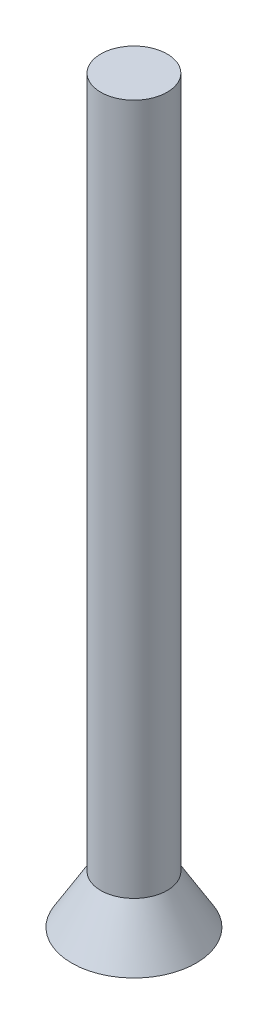
ISO-10303-21;
HEADER;
FILE_DESCRIPTION(('STEP AP214'),'2;1');
FILE_NAME('part.step','',(''),(''),'','','');
FILE_SCHEMA(('AUTOMOTIVE_DESIGN { 1 0 10303 214 1 1 1 1 }'));
ENDSEC;
DATA;
#1=APPLICATION_CONTEXT('core data for automotive mechanical design processes');
#2=APPLICATION_PROTOCOL_DEFINITION('international standard','automotive_design',2000,#1);
#3=PRODUCT_CONTEXT('',#1,'mechanical');
#4=PRODUCT('Part','Part','',(#3));
#5=PRODUCT_RELATED_PRODUCT_CATEGORY('part','',(#4));
#6=PRODUCT_DEFINITION_FORMATION('','',#4);
#7=PRODUCT_DEFINITION_CONTEXT('part definition',#1,'design');
#8=PRODUCT_DEFINITION('design','',#6,#7);
#9=PRODUCT_DEFINITION_SHAPE('','',#8);
#10=(LENGTH_UNIT() NAMED_UNIT(*) SI_UNIT(.MILLI.,.METRE.));
#11=(NAMED_UNIT(*) PLANE_ANGLE_UNIT() SI_UNIT($,.RADIAN.));
#12=(NAMED_UNIT(*) SI_UNIT($,.STERADIAN.) SOLID_ANGLE_UNIT());
#13=UNCERTAINTY_MEASURE_WITH_UNIT(LENGTH_MEASURE(1.E-05),#10,'distance_accuracy_value','');
#14=(GEOMETRIC_REPRESENTATION_CONTEXT(3) GLOBAL_UNCERTAINTY_ASSIGNED_CONTEXT((#13)) GLOBAL_UNIT_ASSIGNED_CONTEXT((#10,
#11,#12)) REPRESENTATION_CONTEXT('',''));
#15=CARTESIAN_POINT('',(0.,0.,0.));
#16=DIRECTION('',(0.,0.,1.));
#17=DIRECTION('',(1.,0.,0.));
#18=AXIS2_PLACEMENT_3D('',#15,#16,#17);
#19=CARTESIAN_POINT('',(0.,0.,0.));
#20=DIRECTION('',(0.,-1.,0.));
#21=DIRECTION('',(0.,0.,1.));
#22=AXIS2_PLACEMENT_3D('',#19,#20,#21);
#23=CONICAL_SURFACE('',#22,4.5,0.541052068118243);
#24=CARTESIAN_POINT('',(0.,3.5,0.));
#25=DIRECTION('',(0.,1.,0.));
#26=DIRECTION('',(0.,0.,1.));
#27=AXIS2_PLACEMENT_3D('',#24,#25,#26);
#28=CIRCLE('',#27,2.4);
#29=CARTESIAN_POINT('',(0.,3.5,2.4));
#30=VERTEX_POINT('',#29);
#31=EDGE_CURVE('E11',#30,#30,#28,.T.);
#32=ORIENTED_EDGE('',*,*,#31,.F.);
#33=EDGE_LOOP('',(#32));
#34=FACE_BOUND('',#33,.T.);
#35=CARTESIAN_POINT('',(0.,0.,0.));
#36=DIRECTION('',(0.,1.,0.));
#37=DIRECTION('',(0.,0.,1.));
#38=AXIS2_PLACEMENT_3D('',#35,#36,#37);
#39=CIRCLE('',#38,4.5);
#40=CARTESIAN_POINT('',(0.,0.,4.5));
#41=VERTEX_POINT('',#40);
#42=EDGE_CURVE('E45',#41,#41,#39,.T.);
#43=ORIENTED_EDGE('',*,*,#42,.T.);
#44=EDGE_LOOP('',(#43));
#45=FACE_BOUND('',#44,.T.);
#46=ADVANCED_FACE('F35',(#34,#45),#23,.T.);
#47=CARTESIAN_POINT('',(0.,0.,0.));
#48=DIRECTION('',(0.,1.,0.));
#49=DIRECTION('',(0.,0.,1.));
#50=AXIS2_PLACEMENT_3D('',#47,#48,#49);
#51=PLANE('',#50);
#52=DIRECTION('',(0.,0.,1.));
#53=VECTOR('',#52,1.);
#54=CARTESIAN_POINT('',(3.23818663626341,0.,0.7));
#55=LINE('',#54,#53);
#56=CARTESIAN_POINT('',(3.23818663626341,0.,-0.7));
#57=VERTEX_POINT('',#56);
#58=CARTESIAN_POINT('',(3.23818663626341,0.,0.7));
#59=VERTEX_POINT('',#58);
#60=EDGE_CURVE('E144',#57,#59,#55,.T.);
#61=ORIENTED_EDGE('',*,*,#60,.F.);
#62=DIRECTION('',(1.,0.,0.));
#63=VECTOR('',#62,1.);
#64=CARTESIAN_POINT('',(3.23818663626341,0.,-0.7));
#65=LINE('',#64,#63);
#66=CARTESIAN_POINT('',(0.699999999999999,0.,-0.7));
#67=VERTEX_POINT('',#66);
#68=EDGE_CURVE('E52',#67,#57,#65,.T.);
#69=ORIENTED_EDGE('',*,*,#68,.F.);
#70=DIRECTION('',(0.,0.,1.));
#71=VECTOR('',#70,1.);
#72=CARTESIAN_POINT('',(0.699999999999999,0.,-0.7));
#73=LINE('',#72,#71);
#74=CARTESIAN_POINT('',(0.7,0.,-3.23818663626341));
#75=VERTEX_POINT('',#74);
#76=EDGE_CURVE('E177',#75,#67,#73,.T.);
#77=ORIENTED_EDGE('',*,*,#76,.F.);
#78=DIRECTION('',(1.,0.,0.));
#79=VECTOR('',#78,1.);
#80=CARTESIAN_POINT('',(0.7,0.,-3.23818663626341));
#81=LINE('',#80,#79);
#82=CARTESIAN_POINT('',(-0.7,0.,-3.23818663626341));
#83=VERTEX_POINT('',#82);
#84=EDGE_CURVE('E175',#83,#75,#81,.T.);
#85=ORIENTED_EDGE('',*,*,#84,.F.);
#86=DIRECTION('',(0.,0.,-1.));
#87=VECTOR('',#86,1.);
#88=CARTESIAN_POINT('',(-0.7,0.,-3.23818663626341));
#89=LINE('',#88,#87);
#90=CARTESIAN_POINT('',(-0.7,0.,-0.7));
#91=VERTEX_POINT('',#90);
#92=EDGE_CURVE('E172',#91,#83,#89,.T.);
#93=ORIENTED_EDGE('',*,*,#92,.F.);
#94=DIRECTION('',(1.,0.,0.));
#95=VECTOR('',#94,1.);
#96=CARTESIAN_POINT('',(-0.7,0.,-0.7));
#97=LINE('',#96,#95);
#98=CARTESIAN_POINT('',(-3.23818663626341,0.,-0.7));
#99=VERTEX_POINT('',#98);
#100=EDGE_CURVE('E169',#99,#91,#97,.T.);
#101=ORIENTED_EDGE('',*,*,#100,.F.);
#102=DIRECTION('',(0.,0.,-1.));
#103=VECTOR('',#102,1.);
#104=CARTESIAN_POINT('',(-3.23818663626341,0.,0.7));
#105=LINE('',#104,#103);
#106=CARTESIAN_POINT('',(-3.23818663626341,0.,0.7));
#107=VERTEX_POINT('',#106);
#108=EDGE_CURVE('E166',#107,#99,#105,.T.);
#109=ORIENTED_EDGE('',*,*,#108,.F.);
#110=DIRECTION('',(-1.,0.,0.));
#111=VECTOR('',#110,1.);
#112=CARTESIAN_POINT('',(-3.23818663626341,0.,0.7));
#113=LINE('',#112,#111);
#114=CARTESIAN_POINT('',(-0.700000000000001,0.,0.7));
#115=VERTEX_POINT('',#114);
#116=EDGE_CURVE('E163',#115,#107,#113,.T.);
#117=ORIENTED_EDGE('',*,*,#116,.F.);
#118=DIRECTION('',(0.,0.,-1.));
#119=VECTOR('',#118,1.);
#120=CARTESIAN_POINT('',(-0.700000000000001,0.,0.7));
#121=LINE('',#120,#119);
#122=CARTESIAN_POINT('',(-0.7,0.,3.23818663626341));
#123=VERTEX_POINT('',#122);
#124=EDGE_CURVE('E160',#123,#115,#121,.T.);
#125=ORIENTED_EDGE('',*,*,#124,.F.);
#126=DIRECTION('',(-1.,0.,0.));
#127=VECTOR('',#126,1.);
#128=CARTESIAN_POINT('',(0.699999999999999,0.,3.23818663626341));
#129=LINE('',#128,#127);
#130=CARTESIAN_POINT('',(0.699999999999999,0.,3.23818663626341));
#131=VERTEX_POINT('',#130);
#132=EDGE_CURVE('E154',#131,#123,#129,.T.);
#133=ORIENTED_EDGE('',*,*,#132,.F.);
#134=DIRECTION('',(0.,0.,1.));
#135=VECTOR('',#134,1.);
#136=CARTESIAN_POINT('',(0.699999999999999,0.,3.23818663626341));
#137=LINE('',#136,#135);
#138=CARTESIAN_POINT('',(0.699999999999999,0.,0.7));
#139=VERTEX_POINT('',#138);
#140=EDGE_CURVE('E152',#139,#131,#137,.T.);
#141=ORIENTED_EDGE('',*,*,#140,.F.);
#142=DIRECTION('',(-1.,0.,0.));
#143=VECTOR('',#142,1.);
#144=CARTESIAN_POINT('',(0.699999999999999,0.,0.7));
#145=LINE('',#144,#143);
#146=EDGE_CURVE('E135',#59,#139,#145,.T.);
#147=ORIENTED_EDGE('',*,*,#146,.F.);
#148=EDGE_LOOP('',(#61,#69,#77,#85,#93,#101,#109,#117,#125,#133,#141,#147));
#149=FACE_BOUND('',#148,.T.);
#150=ORIENTED_EDGE('',*,*,#42,.F.);
#151=EDGE_LOOP('',(#150));
#152=FACE_BOUND('',#151,.T.);
#153=ADVANCED_FACE('F148',(#149,#152),#51,.F.);
#154=CARTESIAN_POINT('',(0.,53.5,0.));
#155=DIRECTION('',(0.,-1.,0.));
#156=DIRECTION('',(0.,0.,-1.));
#157=AXIS2_PLACEMENT_3D('',#154,#155,#156);
#158=CYLINDRICAL_SURFACE('',#157,2.4);
#159=CARTESIAN_POINT('',(0.,53.5,0.));
#160=DIRECTION('',(0.,1.,0.));
#161=DIRECTION('',(0.,0.,1.));
#162=AXIS2_PLACEMENT_3D('',#159,#160,#161);
#163=CIRCLE('',#162,2.4);
#164=CARTESIAN_POINT('',(0.,53.5,2.4));
#165=VERTEX_POINT('',#164);
#166=EDGE_CURVE('E181',#165,#165,#163,.T.);
#167=ORIENTED_EDGE('',*,*,#166,.F.);
#168=EDGE_LOOP('',(#167));
#169=FACE_BOUND('',#168,.T.);
#170=ORIENTED_EDGE('',*,*,#31,.T.);
#171=EDGE_LOOP('',(#170));
#172=FACE_BOUND('',#171,.T.);
#173=ADVANCED_FACE('F240',(#169,#172),#158,.T.);
#174=CARTESIAN_POINT('',(0.,53.5,0.));
#175=DIRECTION('',(0.,1.,0.));
#176=DIRECTION('',(0.,0.,1.));
#177=AXIS2_PLACEMENT_3D('',#174,#175,#176);
#178=PLANE('',#177);
#179=ORIENTED_EDGE('',*,*,#166,.T.);
#180=EDGE_LOOP('',(#179));
#181=FACE_BOUND('',#180,.T.);
#182=ADVANCED_FACE('F249',(#181),#178,.T.);
#183=CARTESIAN_POINT('',(3.23818663626341,0.,-0.7));
#184=DIRECTION('',(0.,0.173648177666931,-0.984807753012208));
#185=DIRECTION('',(0.,0.984807753012208,0.173648177666931));
#186=AXIS2_PLACEMENT_3D('',#183,#184,#185);
#187=PLANE('',#186);
#188=ORIENTED_EDGE('',*,*,#68,.T.);
#189=DIRECTION('',(0.171087869746036,-0.970287525247814,-0.171087869746036));
#190=VECTOR('',#189,1.);
#191=CARTESIAN_POINT('',(3.23818663626341,0.,-0.7));
#192=LINE('',#191,#190);
#193=CARTESIAN_POINT('',(2.88553267484648,2.,-0.347346038583069));
#194=VERTEX_POINT('',#193);
#195=EDGE_CURVE('E95',#194,#57,#192,.T.);
#196=ORIENTED_EDGE('',*,*,#195,.F.);
#197=DIRECTION('',(1.,0.,0.));
#198=VECTOR('',#197,1.);
#199=CARTESIAN_POINT('',(0.,2.,-0.347346038583069));
#200=LINE('',#199,#198);
#201=CARTESIAN_POINT('',(0.347346038583068,2.,-0.347346038583069));
#202=VERTEX_POINT('',#201);
#203=EDGE_CURVE('E179',#202,#194,#200,.T.);
#204=ORIENTED_EDGE('',*,*,#203,.F.);
#205=DIRECTION('',(0.171087869746036,-0.970287525247814,-0.171087869746036));
#206=VECTOR('',#205,1.);
#207=CARTESIAN_POINT('',(0.774295411225322,-0.421350214963193,-0.774295411225323));
#208=LINE('',#207,#206);
#209=EDGE_CURVE('E60',#202,#67,#208,.T.);
#210=ORIENTED_EDGE('',*,*,#209,.T.);
#211=EDGE_LOOP('',(#188,#196,#204,#210));
#212=FACE_BOUND('',#211,.T.);
#213=ADVANCED_FACE('F277',(#212),#187,.F.);
#214=CARTESIAN_POINT('',(0.699999999999999,0.,-0.7));
#215=DIRECTION('',(0.984807753012208,0.173648177666931,0.));
#216=DIRECTION('',(-0.173648177666931,0.984807753012208,0.));
#217=AXIS2_PLACEMENT_3D('',#214,#215,#216);
#218=PLANE('',#217);
#219=ORIENTED_EDGE('',*,*,#76,.T.);
#220=ORIENTED_EDGE('',*,*,#209,.F.);
#221=DIRECTION('',(0.,0.,1.));
#222=VECTOR('',#221,1.);
#223=CARTESIAN_POINT('',(0.347346038583068,2.,0.));
#224=LINE('',#223,#222);
#225=CARTESIAN_POINT('',(0.34734603858307,2.,-2.88553267484648));
#226=VERTEX_POINT('',#225);
#227=EDGE_CURVE('E182',#226,#202,#224,.T.);
#228=ORIENTED_EDGE('',*,*,#227,.F.);
#229=DIRECTION('',(0.171087869746036,-0.970287525247814,-0.171087869746036));
#230=VECTOR('',#229,1.);
#231=CARTESIAN_POINT('',(0.7,0.,-3.23818663626341));
#232=LINE('',#231,#230);
#233=EDGE_CURVE('E100',#226,#75,#232,.T.);
#234=ORIENTED_EDGE('',*,*,#233,.T.);
#235=EDGE_LOOP('',(#219,#220,#228,#234));
#236=FACE_BOUND('',#235,.T.);
#237=ADVANCED_FACE('F290',(#236),#218,.F.);
#238=CARTESIAN_POINT('',(0.7,0.,-3.23818663626341));
#239=DIRECTION('',(0.,0.173648177666931,-0.984807753012208));
#240=DIRECTION('',(0.,0.984807753012208,0.173648177666931));
#241=AXIS2_PLACEMENT_3D('',#238,#239,#240);
#242=PLANE('',#241);
#243=ORIENTED_EDGE('',*,*,#84,.T.);
#244=ORIENTED_EDGE('',*,*,#233,.F.);
#245=DIRECTION('',(1.,0.,0.));
#246=VECTOR('',#245,1.);
#247=CARTESIAN_POINT('',(0.,2.,-2.88553267484648));
#248=LINE('',#247,#246);
#249=CARTESIAN_POINT('',(-0.347346038583069,2.,-2.88553267484648));
#250=VERTEX_POINT('',#249);
#251=EDGE_CURVE('E205',#250,#226,#248,.T.);
#252=ORIENTED_EDGE('',*,*,#251,.F.);
#253=DIRECTION('',(-0.171087869746036,-0.970287525247814,-0.171087869746036));
#254=VECTOR('',#253,1.);
#255=CARTESIAN_POINT('',(-0.7,0.,-3.23818663626341));
#256=LINE('',#255,#254);
#257=EDGE_CURVE('E197',#250,#83,#256,.T.);
#258=ORIENTED_EDGE('',*,*,#257,.T.);
#259=EDGE_LOOP('',(#243,#244,#252,#258));
#260=FACE_BOUND('',#259,.T.);
#261=ADVANCED_FACE('F299',(#260),#242,.F.);
#262=CARTESIAN_POINT('',(-0.7,0.,-3.23818663626341));
#263=DIRECTION('',(-0.984807753012208,0.173648177666931,0.));
#264=DIRECTION('',(-0.173648177666931,-0.984807753012208,0.));
#265=AXIS2_PLACEMENT_3D('',#262,#263,#264);
#266=PLANE('',#265);
#267=ORIENTED_EDGE('',*,*,#92,.T.);
#268=ORIENTED_EDGE('',*,*,#257,.F.);
#269=DIRECTION('',(0.,0.,-1.));
#270=VECTOR('',#269,1.);
#271=CARTESIAN_POINT('',(-0.34734603858307,2.,0.));
#272=LINE('',#271,#270);
#273=CARTESIAN_POINT('',(-0.34734603858307,2.,-0.347346038583069));
#274=VERTEX_POINT('',#273);
#275=EDGE_CURVE('E208',#274,#250,#272,.T.);
#276=ORIENTED_EDGE('',*,*,#275,.F.);
#277=DIRECTION('',(-0.171087869746036,-0.970287525247814,-0.171087869746036));
#278=VECTOR('',#277,1.);
#279=CARTESIAN_POINT('',(-0.774295411225323,-0.421350214963192,-0.774295411225323));
#280=LINE('',#279,#278);
#281=EDGE_CURVE('E195',#274,#91,#280,.T.);
#282=ORIENTED_EDGE('',*,*,#281,.T.);
#283=EDGE_LOOP('',(#267,#268,#276,#282));
#284=FACE_BOUND('',#283,.T.);
#285=ADVANCED_FACE('F307',(#284),#266,.F.);
#286=CARTESIAN_POINT('',(-0.7,0.,-0.7));
#287=DIRECTION('',(0.,0.173648177666931,-0.984807753012208));
#288=DIRECTION('',(0.,0.984807753012208,0.173648177666931));
#289=AXIS2_PLACEMENT_3D('',#286,#287,#288);
#290=PLANE('',#289);
#291=ORIENTED_EDGE('',*,*,#100,.T.);
#292=ORIENTED_EDGE('',*,*,#281,.F.);
#293=DIRECTION('',(1.,0.,0.));
#294=VECTOR('',#293,1.);
#295=CARTESIAN_POINT('',(0.,2.,-0.347346038583069));
#296=LINE('',#295,#294);
#297=CARTESIAN_POINT('',(-2.88553267484648,2.,-0.347346038583069));
#298=VERTEX_POINT('',#297);
#299=EDGE_CURVE('E211',#298,#274,#296,.T.);
#300=ORIENTED_EDGE('',*,*,#299,.F.);
#301=DIRECTION('',(-0.171087869746036,-0.970287525247814,-0.171087869746036));
#302=VECTOR('',#301,1.);
#303=CARTESIAN_POINT('',(-3.19720715341948,0.232406196030122,-0.659020517156069));
#304=LINE('',#303,#302);
#305=EDGE_CURVE('E193',#298,#99,#304,.T.);
#306=ORIENTED_EDGE('',*,*,#305,.T.);
#307=EDGE_LOOP('',(#291,#292,#300,#306));
#308=FACE_BOUND('',#307,.T.);
#309=ADVANCED_FACE('F317',(#308),#290,.F.);
#310=CARTESIAN_POINT('',(-3.23818663626341,0.,0.7));
#311=DIRECTION('',(-0.984807753012208,0.173648177666931,0.));
#312=DIRECTION('',(-0.173648177666931,-0.984807753012208,0.));
#313=AXIS2_PLACEMENT_3D('',#310,#311,#312);
#314=PLANE('',#313);
#315=ORIENTED_EDGE('',*,*,#108,.T.);
#316=ORIENTED_EDGE('',*,*,#305,.F.);
#317=DIRECTION('',(0.,0.,-1.));
#318=VECTOR('',#317,1.);
#319=CARTESIAN_POINT('',(-2.88553267484648,2.,0.));
#320=LINE('',#319,#318);
#321=CARTESIAN_POINT('',(-2.88553267484648,2.,0.347346038583069));
#322=VERTEX_POINT('',#321);
#323=EDGE_CURVE('E214',#322,#298,#320,.T.);
#324=ORIENTED_EDGE('',*,*,#323,.F.);
#325=DIRECTION('',(-0.171087869746036,-0.970287525247814,0.171087869746036));
#326=VECTOR('',#325,1.);
#327=CARTESIAN_POINT('',(-3.23818663626341,0.,0.7));
#328=LINE('',#327,#326);
#329=EDGE_CURVE('E191',#322,#107,#328,.T.);
#330=ORIENTED_EDGE('',*,*,#329,.T.);
#331=EDGE_LOOP('',(#315,#316,#324,#330));
#332=FACE_BOUND('',#331,.T.);
#333=ADVANCED_FACE('F327',(#332),#314,.F.);
#334=CARTESIAN_POINT('',(-3.23818663626341,0.,0.7));
#335=DIRECTION('',(0.,0.173648177666931,0.984807753012208));
#336=DIRECTION('',(0.,-0.984807753012208,0.173648177666931));
#337=AXIS2_PLACEMENT_3D('',#334,#335,#336);
#338=PLANE('',#337);
#339=ORIENTED_EDGE('',*,*,#116,.T.);
#340=ORIENTED_EDGE('',*,*,#329,.F.);
#341=DIRECTION('',(-1.,0.,0.));
#342=VECTOR('',#341,1.);
#343=CARTESIAN_POINT('',(0.,2.,0.347346038583069));
#344=LINE('',#343,#342);
#345=CARTESIAN_POINT('',(-0.34734603858307,2.,0.347346038583069));
#346=VERTEX_POINT('',#345);
#347=EDGE_CURVE('E217',#346,#322,#344,.T.);
#348=ORIENTED_EDGE('',*,*,#347,.F.);
#349=DIRECTION('',(-0.171087869746036,-0.970287525247814,0.171087869746036));
#350=VECTOR('',#349,1.);
#351=CARTESIAN_POINT('',(-0.774295411225323,-0.421350214963192,0.774295411225322));
#352=LINE('',#351,#350);
#353=EDGE_CURVE('E189',#346,#115,#352,.T.);
#354=ORIENTED_EDGE('',*,*,#353,.T.);
#355=EDGE_LOOP('',(#339,#340,#348,#354));
#356=FACE_BOUND('',#355,.T.);
#357=ADVANCED_FACE('F337',(#356),#338,.F.);
#358=CARTESIAN_POINT('',(-0.700000000000001,0.,0.7));
#359=DIRECTION('',(-0.984807753012208,0.173648177666931,0.));
#360=DIRECTION('',(-0.173648177666931,-0.984807753012208,0.));
#361=AXIS2_PLACEMENT_3D('',#358,#359,#360);
#362=PLANE('',#361);
#363=ORIENTED_EDGE('',*,*,#124,.T.);
#364=ORIENTED_EDGE('',*,*,#353,.F.);
#365=DIRECTION('',(0.,0.,-1.));
#366=VECTOR('',#365,1.);
#367=CARTESIAN_POINT('',(-0.34734603858307,2.,0.));
#368=LINE('',#367,#366);
#369=CARTESIAN_POINT('',(-0.34734603858307,2.,2.88553267484648));
#370=VERTEX_POINT('',#369);
#371=EDGE_CURVE('E220',#370,#346,#368,.T.);
#372=ORIENTED_EDGE('',*,*,#371,.F.);
#373=DIRECTION('',(-0.171087869746036,-0.970287525247814,0.171087869746036));
#374=VECTOR('',#373,1.);
#375=CARTESIAN_POINT('',(-0.659020517156069,0.232406196030122,3.19720715341948));
#376=LINE('',#375,#374);
#377=EDGE_CURVE('E187',#370,#123,#376,.T.);
#378=ORIENTED_EDGE('',*,*,#377,.T.);
#379=EDGE_LOOP('',(#363,#364,#372,#378));
#380=FACE_BOUND('',#379,.T.);
#381=ADVANCED_FACE('F347',(#380),#362,.F.);
#382=CARTESIAN_POINT('',(0.699999999999999,0.,3.23818663626341));
#383=DIRECTION('',(0.,0.173648177666931,0.984807753012208));
#384=DIRECTION('',(0.,-0.984807753012208,0.173648177666931));
#385=AXIS2_PLACEMENT_3D('',#382,#383,#384);
#386=PLANE('',#385);
#387=ORIENTED_EDGE('',*,*,#132,.T.);
#388=ORIENTED_EDGE('',*,*,#377,.F.);
#389=DIRECTION('',(-1.,0.,0.));
#390=VECTOR('',#389,1.);
#391=CARTESIAN_POINT('',(0.,2.,2.88553267484648));
#392=LINE('',#391,#390);
#393=CARTESIAN_POINT('',(0.347346038583069,2.,2.88553267484648));
#394=VERTEX_POINT('',#393);
#395=EDGE_CURVE('E223',#394,#370,#392,.T.);
#396=ORIENTED_EDGE('',*,*,#395,.F.);
#397=DIRECTION('',(0.171087869746036,-0.970287525247814,0.171087869746036));
#398=VECTOR('',#397,1.);
#399=CARTESIAN_POINT('',(0.699999999999999,0.,3.23818663626341));
#400=LINE('',#399,#398);
#401=EDGE_CURVE('E185',#394,#131,#400,.T.);
#402=ORIENTED_EDGE('',*,*,#401,.T.);
#403=EDGE_LOOP('',(#387,#388,#396,#402));
#404=FACE_BOUND('',#403,.T.);
#405=ADVANCED_FACE('F357',(#404),#386,.F.);
#406=CARTESIAN_POINT('',(0.699999999999999,0.,3.23818663626341));
#407=DIRECTION('',(0.984807753012208,0.173648177666931,0.));
#408=DIRECTION('',(-0.173648177666931,0.984807753012208,0.));
#409=AXIS2_PLACEMENT_3D('',#406,#407,#408);
#410=PLANE('',#409);
#411=ORIENTED_EDGE('',*,*,#140,.T.);
#412=ORIENTED_EDGE('',*,*,#401,.F.);
#413=DIRECTION('',(0.,0.,1.));
#414=VECTOR('',#413,1.);
#415=CARTESIAN_POINT('',(0.347346038583068,2.,0.));
#416=LINE('',#415,#414);
#417=CARTESIAN_POINT('',(0.347346038583068,2.,0.347346038583069));
#418=VERTEX_POINT('',#417);
#419=EDGE_CURVE('E226',#418,#394,#416,.T.);
#420=ORIENTED_EDGE('',*,*,#419,.F.);
#421=DIRECTION('',(0.171087869746036,-0.970287525247814,0.171087869746036));
#422=VECTOR('',#421,1.);
#423=CARTESIAN_POINT('',(0.774295411225322,-0.421350214963193,0.774295411225323));
#424=LINE('',#423,#422);
#425=EDGE_CURVE('E141',#418,#139,#424,.T.);
#426=ORIENTED_EDGE('',*,*,#425,.T.);
#427=EDGE_LOOP('',(#411,#412,#420,#426));
#428=FACE_BOUND('',#427,.T.);
#429=ADVANCED_FACE('F367',(#428),#410,.F.);
#430=CARTESIAN_POINT('',(0.699999999999999,0.,0.7));
#431=DIRECTION('',(0.,0.173648177666931,0.984807753012208));
#432=DIRECTION('',(0.,-0.984807753012208,0.173648177666931));
#433=AXIS2_PLACEMENT_3D('',#430,#431,#432);
#434=PLANE('',#433);
#435=ORIENTED_EDGE('',*,*,#146,.T.);
#436=ORIENTED_EDGE('',*,*,#425,.F.);
#437=DIRECTION('',(-1.,0.,0.));
#438=VECTOR('',#437,1.);
#439=CARTESIAN_POINT('',(0.,2.,0.347346038583069));
#440=LINE('',#439,#438);
#441=CARTESIAN_POINT('',(2.88553267484648,2.,0.347346038583069));
#442=VERTEX_POINT('',#441);
#443=EDGE_CURVE('E138',#442,#418,#440,.T.);
#444=ORIENTED_EDGE('',*,*,#443,.F.);
#445=DIRECTION('',(0.171087869746036,-0.970287525247814,0.171087869746036));
#446=VECTOR('',#445,1.);
#447=CARTESIAN_POINT('',(3.23818663626341,0.,0.7));
#448=LINE('',#447,#446);
#449=EDGE_CURVE('E131',#442,#59,#448,.T.);
#450=ORIENTED_EDGE('',*,*,#449,.T.);
#451=EDGE_LOOP('',(#435,#436,#444,#450));
#452=FACE_BOUND('',#451,.T.);
#453=ADVANCED_FACE('F133',(#452),#434,.F.);
#454=CARTESIAN_POINT('',(3.23818663626341,0.,0.7));
#455=DIRECTION('',(0.984807753012208,0.173648177666931,0.));
#456=DIRECTION('',(-0.173648177666931,0.984807753012208,0.));
#457=AXIS2_PLACEMENT_3D('',#454,#455,#456);
#458=PLANE('',#457);
#459=ORIENTED_EDGE('',*,*,#60,.T.);
#460=ORIENTED_EDGE('',*,*,#449,.F.);
#461=DIRECTION('',(0.,0.,1.));
#462=VECTOR('',#461,1.);
#463=CARTESIAN_POINT('',(2.88553267484648,2.,0.));
#464=LINE('',#463,#462);
#465=EDGE_CURVE('E202',#194,#442,#464,.T.);
#466=ORIENTED_EDGE('',*,*,#465,.F.);
#467=ORIENTED_EDGE('',*,*,#195,.T.);
#468=EDGE_LOOP('',(#459,#460,#466,#467));
#469=FACE_BOUND('',#468,.T.);
#470=ADVANCED_FACE('F145',(#469),#458,.F.);
#471=CARTESIAN_POINT('',(0.,2.,0.));
#472=DIRECTION('',(0.,-1.,0.));
#473=DIRECTION('',(0.,0.,-1.));
#474=AXIS2_PLACEMENT_3D('',#471,#472,#473);
#475=PLANE('',#474);
#476=ORIENTED_EDGE('',*,*,#203,.T.);
#477=ORIENTED_EDGE('',*,*,#465,.T.);
#478=ORIENTED_EDGE('',*,*,#443,.T.);
#479=ORIENTED_EDGE('',*,*,#419,.T.);
#480=ORIENTED_EDGE('',*,*,#395,.T.);
#481=ORIENTED_EDGE('',*,*,#371,.T.);
#482=ORIENTED_EDGE('',*,*,#347,.T.);
#483=ORIENTED_EDGE('',*,*,#323,.T.);
#484=ORIENTED_EDGE('',*,*,#299,.T.);
#485=ORIENTED_EDGE('',*,*,#275,.T.);
#486=ORIENTED_EDGE('',*,*,#251,.T.);
#487=ORIENTED_EDGE('',*,*,#227,.T.);
#488=EDGE_LOOP('',(#476,#477,#478,#479,#480,#481,#482,#483,#484,#485,#486,#487));
#489=FACE_BOUND('',#488,.T.);
#490=ADVANCED_FACE('F394',(#489),#475,.T.);
#491=CLOSED_SHELL('',(#46,#153,#173,#182,#213,#237,#261,#285,#309,#333,#357,#381,#405,#429,#453,
#470,#490));
#492=MANIFOLD_SOLID_BREP('B2',#491);
#493=ADVANCED_BREP_SHAPE_REPRESENTATION('',(#18,#492),#14);
#494=SHAPE_DEFINITION_REPRESENTATION(#9,#493);
ENDSEC;
END-ISO-10303-21;
